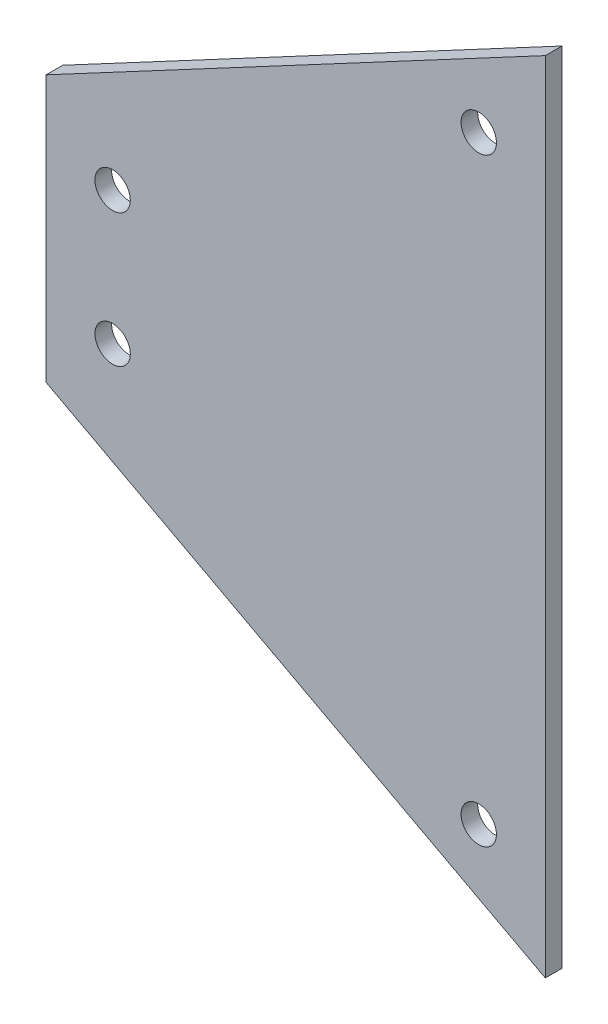
ISO-10303-21;
HEADER;
FILE_DESCRIPTION(('STEP AP214'),'2;1');
FILE_NAME('part.step','',(''),(''),'','','');
FILE_SCHEMA(('AUTOMOTIVE_DESIGN { 1 0 10303 214 1 1 1 1 }'));
ENDSEC;
DATA;
#1=APPLICATION_CONTEXT('core data for automotive mechanical design processes');
#2=APPLICATION_PROTOCOL_DEFINITION('international standard','automotive_design',2000,#1);
#3=PRODUCT_CONTEXT('',#1,'mechanical');
#4=PRODUCT('Part','Part','',(#3));
#5=PRODUCT_RELATED_PRODUCT_CATEGORY('part','',(#4));
#6=PRODUCT_DEFINITION_FORMATION('','',#4);
#7=PRODUCT_DEFINITION_CONTEXT('part definition',#1,'design');
#8=PRODUCT_DEFINITION('design','',#6,#7);
#9=PRODUCT_DEFINITION_SHAPE('','',#8);
#10=(LENGTH_UNIT() NAMED_UNIT(*) SI_UNIT(.MILLI.,.METRE.));
#11=(NAMED_UNIT(*) PLANE_ANGLE_UNIT() SI_UNIT($,.RADIAN.));
#12=(NAMED_UNIT(*) SI_UNIT($,.STERADIAN.) SOLID_ANGLE_UNIT());
#13=UNCERTAINTY_MEASURE_WITH_UNIT(LENGTH_MEASURE(1.E-05),#10,'distance_accuracy_value','');
#14=(GEOMETRIC_REPRESENTATION_CONTEXT(3) GLOBAL_UNCERTAINTY_ASSIGNED_CONTEXT((#13)) GLOBAL_UNIT_ASSIGNED_CONTEXT((#10,
#11,#12)) REPRESENTATION_CONTEXT('',''));
#15=CARTESIAN_POINT('',(0.,0.,0.));
#16=DIRECTION('',(0.,0.,1.));
#17=DIRECTION('',(1.,0.,0.));
#18=AXIS2_PLACEMENT_3D('',#15,#16,#17);
#19=CARTESIAN_POINT('',(-95.25,0.,1.5875));
#20=DIRECTION('',(-1.,0.,0.));
#21=DIRECTION('',(0.,0.,1.));
#22=AXIS2_PLACEMENT_3D('',#19,#20,#21);
#23=PLANE('',#22);
#24=DIRECTION('',(0.,1.,0.));
#25=VECTOR('',#24,1.);
#26=CARTESIAN_POINT('',(-95.25,0.,-1.5875));
#27=LINE('',#26,#25);
#28=CARTESIAN_POINT('',(-95.25,-25.4,-1.5875));
#29=VERTEX_POINT('',#28);
#30=CARTESIAN_POINT('',(-95.25,25.4,-1.5875));
#31=VERTEX_POINT('',#30);
#32=EDGE_CURVE('E99',#29,#31,#27,.T.);
#33=ORIENTED_EDGE('',*,*,#32,.F.);
#34=DIRECTION('',(0.,0.,-1.));
#35=VECTOR('',#34,1.);
#36=CARTESIAN_POINT('',(-95.25,-25.4,1.5875));
#37=LINE('',#36,#35);
#38=CARTESIAN_POINT('',(-95.25,-25.4,1.5875));
#39=VERTEX_POINT('',#38);
#40=EDGE_CURVE('E11',#39,#29,#37,.T.);
#41=ORIENTED_EDGE('',*,*,#40,.F.);
#42=DIRECTION('',(0.,1.,0.));
#43=VECTOR('',#42,1.);
#44=CARTESIAN_POINT('',(-95.25,0.,1.5875));
#45=LINE('',#44,#43);
#46=CARTESIAN_POINT('',(-95.25,25.4,1.5875));
#47=VERTEX_POINT('',#46);
#48=EDGE_CURVE('E92',#39,#47,#45,.T.);
#49=ORIENTED_EDGE('',*,*,#48,.T.);
#50=DIRECTION('',(0.,0.,-1.));
#51=VECTOR('',#50,1.);
#52=CARTESIAN_POINT('',(-95.25,25.4,1.5875));
#53=LINE('',#52,#51);
#54=EDGE_CURVE('E73',#47,#31,#53,.T.);
#55=ORIENTED_EDGE('',*,*,#54,.T.);
#56=EDGE_LOOP('',(#33,#41,#49,#55));
#57=FACE_BOUND('',#56,.T.);
#58=ADVANCED_FACE('F35',(#57),#23,.T.);
#59=CARTESIAN_POINT('',(-31.6401384083045,-59.3252595155709,1.5875));
#60=DIRECTION('',(-0.470588235294118,-0.88235294117647,0.));
#61=DIRECTION('',(0.882352941176471,-0.470588235294118,0.));
#62=AXIS2_PLACEMENT_3D('',#59,#60,#61);
#63=PLANE('',#62);
#64=DIRECTION('',(-0.882352941176471,0.470588235294118,0.));
#65=VECTOR('',#64,1.);
#66=CARTESIAN_POINT('',(-31.6401384083045,-59.3252595155709,-1.5875));
#67=LINE('',#66,#65);
#68=CARTESIAN_POINT('',(0.,-76.2,-1.5875));
#69=VERTEX_POINT('',#68);
#70=EDGE_CURVE('E86',#69,#29,#67,.T.);
#71=ORIENTED_EDGE('',*,*,#70,.F.);
#72=DIRECTION('',(0.,0.,-1.));
#73=VECTOR('',#72,1.);
#74=CARTESIAN_POINT('',(0.,-76.2,1.5875));
#75=LINE('',#74,#73);
#76=CARTESIAN_POINT('',(0.,-76.2,1.5875));
#77=VERTEX_POINT('',#76);
#78=EDGE_CURVE('E43',#77,#69,#75,.T.);
#79=ORIENTED_EDGE('',*,*,#78,.F.);
#80=DIRECTION('',(-0.882352941176471,0.470588235294118,0.));
#81=VECTOR('',#80,1.);
#82=CARTESIAN_POINT('',(-31.6401384083045,-59.3252595155709,1.5875));
#83=LINE('',#82,#81);
#84=EDGE_CURVE('E84',#77,#39,#83,.T.);
#85=ORIENTED_EDGE('',*,*,#84,.T.);
#86=ORIENTED_EDGE('',*,*,#40,.T.);
#87=EDGE_LOOP('',(#71,#79,#85,#86));
#88=FACE_BOUND('',#87,.T.);
#89=ADVANCED_FACE('F82',(#88),#63,.T.);
#90=CARTESIAN_POINT('',(0.,0.,1.5875));
#91=DIRECTION('',(-1.,0.,0.));
#92=DIRECTION('',(0.,-1.,0.));
#93=AXIS2_PLACEMENT_3D('',#90,#91,#92);
#94=PLANE('',#93);
#95=DIRECTION('',(0.,1.,0.));
#96=VECTOR('',#95,1.);
#97=CARTESIAN_POINT('',(0.,0.,-1.5875));
#98=LINE('',#97,#96);
#99=CARTESIAN_POINT('',(0.,76.2,-1.5875));
#100=VERTEX_POINT('',#99);
#101=EDGE_CURVE('E66',#69,#100,#98,.T.);
#102=ORIENTED_EDGE('',*,*,#101,.T.);
#103=DIRECTION('',(0.,0.,-1.));
#104=VECTOR('',#103,1.);
#105=CARTESIAN_POINT('',(0.,76.2,1.5875));
#106=LINE('',#105,#104);
#107=CARTESIAN_POINT('',(0.,76.2,1.5875));
#108=VERTEX_POINT('',#107);
#109=EDGE_CURVE('E87',#108,#100,#106,.T.);
#110=ORIENTED_EDGE('',*,*,#109,.F.);
#111=DIRECTION('',(0.,1.,0.));
#112=VECTOR('',#111,1.);
#113=CARTESIAN_POINT('',(0.,0.,1.5875));
#114=LINE('',#113,#112);
#115=EDGE_CURVE('E88',#77,#108,#114,.T.);
#116=ORIENTED_EDGE('',*,*,#115,.F.);
#117=ORIENTED_EDGE('',*,*,#78,.T.);
#118=EDGE_LOOP('',(#102,#110,#116,#117));
#119=FACE_BOUND('',#118,.T.);
#120=ADVANCED_FACE('F89',(#119),#94,.F.);
#121=CARTESIAN_POINT('',(-31.6401384083045,59.3252595155709,1.5875));
#122=DIRECTION('',(0.470588235294118,-0.88235294117647,0.));
#123=DIRECTION('',(0.882352941176471,0.470588235294118,0.));
#124=AXIS2_PLACEMENT_3D('',#121,#122,#123);
#125=PLANE('',#124);
#126=DIRECTION('',(-0.882352941176471,-0.470588235294118,0.));
#127=VECTOR('',#126,1.);
#128=CARTESIAN_POINT('',(-31.6401384083045,59.3252595155709,-1.5875));
#129=LINE('',#128,#127);
#130=EDGE_CURVE('E94',#100,#31,#129,.T.);
#131=ORIENTED_EDGE('',*,*,#130,.T.);
#132=ORIENTED_EDGE('',*,*,#54,.F.);
#133=DIRECTION('',(-0.882352941176471,-0.470588235294118,0.));
#134=VECTOR('',#133,1.);
#135=CARTESIAN_POINT('',(-31.6401384083045,59.3252595155709,1.5875));
#136=LINE('',#135,#134);
#137=EDGE_CURVE('E51',#108,#47,#136,.T.);
#138=ORIENTED_EDGE('',*,*,#137,.F.);
#139=ORIENTED_EDGE('',*,*,#109,.T.);
#140=EDGE_LOOP('',(#131,#132,#138,#139));
#141=FACE_BOUND('',#140,.T.);
#142=ADVANCED_FACE('F109',(#141),#125,.F.);
#143=CARTESIAN_POINT('',(0.,0.,1.5875));
#144=DIRECTION('',(0.,0.,1.));
#145=DIRECTION('',(1.,0.,0.));
#146=AXIS2_PLACEMENT_3D('',#143,#144,#145);
#147=PLANE('',#146);
#148=CARTESIAN_POINT('',(-82.55,12.7,1.5875));
#149=DIRECTION('',(0.,0.,1.));
#150=DIRECTION('',(1.,0.,0.));
#151=AXIS2_PLACEMENT_3D('',#148,#149,#150);
#152=CIRCLE('',#151,3.373501);
#153=CARTESIAN_POINT('',(-79.176499,12.7,1.5875));
#154=VERTEX_POINT('',#153);
#155=EDGE_CURVE('E152',#154,#154,#152,.T.);
#156=ORIENTED_EDGE('',*,*,#155,.F.);
#157=EDGE_LOOP('',(#156));
#158=FACE_BOUND('',#157,.T.);
#159=CARTESIAN_POINT('',(-82.55,-12.7,1.5875));
#160=DIRECTION('',(0.,0.,1.));
#161=DIRECTION('',(1.,0.,0.));
#162=AXIS2_PLACEMENT_3D('',#159,#160,#161);
#163=CIRCLE('',#162,3.373501);
#164=CARTESIAN_POINT('',(-79.176499,-12.7,1.5875));
#165=VERTEX_POINT('',#164);
#166=EDGE_CURVE('E154',#165,#165,#163,.T.);
#167=ORIENTED_EDGE('',*,*,#166,.F.);
#168=EDGE_LOOP('',(#167));
#169=FACE_BOUND('',#168,.T.);
#170=CARTESIAN_POINT('',(-12.7,-57.15,1.5875));
#171=DIRECTION('',(0.,0.,1.));
#172=DIRECTION('',(1.,0.,0.));
#173=AXIS2_PLACEMENT_3D('',#170,#171,#172);
#174=CIRCLE('',#173,3.373501);
#175=CARTESIAN_POINT('',(-9.32649899999997,-57.15,1.5875));
#176=VERTEX_POINT('',#175);
#177=EDGE_CURVE('E162',#176,#176,#174,.T.);
#178=ORIENTED_EDGE('',*,*,#177,.F.);
#179=EDGE_LOOP('',(#178));
#180=FACE_BOUND('',#179,.T.);
#181=CARTESIAN_POINT('',(-12.7,57.15,1.5875));
#182=DIRECTION('',(0.,0.,1.));
#183=DIRECTION('',(1.,0.,0.));
#184=AXIS2_PLACEMENT_3D('',#181,#182,#183);
#185=CIRCLE('',#184,3.373501);
#186=CARTESIAN_POINT('',(-9.32649899999998,57.15,1.5875));
#187=VERTEX_POINT('',#186);
#188=EDGE_CURVE('E168',#187,#187,#185,.T.);
#189=ORIENTED_EDGE('',*,*,#188,.F.);
#190=EDGE_LOOP('',(#189));
#191=FACE_BOUND('',#190,.T.);
#192=ORIENTED_EDGE('',*,*,#48,.F.);
#193=ORIENTED_EDGE('',*,*,#84,.F.);
#194=ORIENTED_EDGE('',*,*,#115,.T.);
#195=ORIENTED_EDGE('',*,*,#137,.T.);
#196=EDGE_LOOP('',(#192,#193,#194,#195));
#197=FACE_BOUND('',#196,.T.);
#198=ADVANCED_FACE('F91',(#158,#169,#180,#191,#197),#147,.T.);
#199=CARTESIAN_POINT('',(0.,0.,-1.5875));
#200=DIRECTION('',(0.,0.,1.));
#201=DIRECTION('',(1.,0.,0.));
#202=AXIS2_PLACEMENT_3D('',#199,#200,#201);
#203=PLANE('',#202);
#204=CARTESIAN_POINT('',(-82.55,12.7,-1.5875));
#205=DIRECTION('',(0.,0.,1.));
#206=DIRECTION('',(1.,0.,0.));
#207=AXIS2_PLACEMENT_3D('',#204,#205,#206);
#208=CIRCLE('',#207,3.373501);
#209=CARTESIAN_POINT('',(-79.176499,12.7,-1.5875));
#210=VERTEX_POINT('',#209);
#211=EDGE_CURVE('E149',#210,#210,#208,.T.);
#212=ORIENTED_EDGE('',*,*,#211,.T.);
#213=EDGE_LOOP('',(#212));
#214=FACE_BOUND('',#213,.T.);
#215=CARTESIAN_POINT('',(-82.55,-12.7,-1.5875));
#216=DIRECTION('',(0.,0.,1.));
#217=DIRECTION('',(1.,0.,0.));
#218=AXIS2_PLACEMENT_3D('',#215,#216,#217);
#219=CIRCLE('',#218,3.373501);
#220=CARTESIAN_POINT('',(-79.176499,-12.7,-1.5875));
#221=VERTEX_POINT('',#220);
#222=EDGE_CURVE('E159',#221,#221,#219,.T.);
#223=ORIENTED_EDGE('',*,*,#222,.T.);
#224=EDGE_LOOP('',(#223));
#225=FACE_BOUND('',#224,.T.);
#226=CARTESIAN_POINT('',(-12.7,-57.15,-1.5875));
#227=DIRECTION('',(0.,0.,1.));
#228=DIRECTION('',(1.,0.,0.));
#229=AXIS2_PLACEMENT_3D('',#226,#227,#228);
#230=CIRCLE('',#229,3.373501);
#231=CARTESIAN_POINT('',(-9.32649899999997,-57.15,-1.5875));
#232=VERTEX_POINT('',#231);
#233=EDGE_CURVE('E165',#232,#232,#230,.T.);
#234=ORIENTED_EDGE('',*,*,#233,.T.);
#235=EDGE_LOOP('',(#234));
#236=FACE_BOUND('',#235,.T.);
#237=CARTESIAN_POINT('',(-12.7,57.15,-1.5875));
#238=DIRECTION('',(0.,0.,1.));
#239=DIRECTION('',(1.,0.,0.));
#240=AXIS2_PLACEMENT_3D('',#237,#238,#239);
#241=CIRCLE('',#240,3.373501);
#242=CARTESIAN_POINT('',(-9.32649899999998,57.15,-1.5875));
#243=VERTEX_POINT('',#242);
#244=EDGE_CURVE('E102',#243,#243,#241,.T.);
#245=ORIENTED_EDGE('',*,*,#244,.T.);
#246=EDGE_LOOP('',(#245));
#247=FACE_BOUND('',#246,.T.);
#248=ORIENTED_EDGE('',*,*,#32,.T.);
#249=ORIENTED_EDGE('',*,*,#130,.F.);
#250=ORIENTED_EDGE('',*,*,#101,.F.);
#251=ORIENTED_EDGE('',*,*,#70,.T.);
#252=EDGE_LOOP('',(#248,#249,#250,#251));
#253=FACE_BOUND('',#252,.T.);
#254=ADVANCED_FACE('F111',(#214,#225,#236,#247,#253),#203,.F.);
#255=CARTESIAN_POINT('',(-12.7,57.15,1.5875));
#256=DIRECTION('',(0.,0.,1.));
#257=DIRECTION('',(1.,0.,0.));
#258=AXIS2_PLACEMENT_3D('',#255,#256,#257);
#259=CYLINDRICAL_SURFACE('',#258,3.373501);
#260=ORIENTED_EDGE('',*,*,#244,.F.);
#261=EDGE_LOOP('',(#260));
#262=FACE_BOUND('',#261,.T.);
#263=ORIENTED_EDGE('',*,*,#188,.T.);
#264=EDGE_LOOP('',(#263));
#265=FACE_BOUND('',#264,.T.);
#266=ADVANCED_FACE('F125',(#262,#265),#259,.F.);
#267=CARTESIAN_POINT('',(-12.7,-57.15,1.5875));
#268=DIRECTION('',(0.,0.,1.));
#269=DIRECTION('',(1.,0.,0.));
#270=AXIS2_PLACEMENT_3D('',#267,#268,#269);
#271=CYLINDRICAL_SURFACE('',#270,3.373501);
#272=ORIENTED_EDGE('',*,*,#233,.F.);
#273=EDGE_LOOP('',(#272));
#274=FACE_BOUND('',#273,.T.);
#275=ORIENTED_EDGE('',*,*,#177,.T.);
#276=EDGE_LOOP('',(#275));
#277=FACE_BOUND('',#276,.T.);
#278=ADVANCED_FACE('F132',(#274,#277),#271,.F.);
#279=CARTESIAN_POINT('',(-82.55,-12.7,1.5875));
#280=DIRECTION('',(0.,0.,1.));
#281=DIRECTION('',(1.,0.,0.));
#282=AXIS2_PLACEMENT_3D('',#279,#280,#281);
#283=CYLINDRICAL_SURFACE('',#282,3.373501);
#284=ORIENTED_EDGE('',*,*,#222,.F.);
#285=EDGE_LOOP('',(#284));
#286=FACE_BOUND('',#285,.T.);
#287=ORIENTED_EDGE('',*,*,#166,.T.);
#288=EDGE_LOOP('',(#287));
#289=FACE_BOUND('',#288,.T.);
#290=ADVANCED_FACE('F136',(#286,#289),#283,.F.);
#291=CARTESIAN_POINT('',(-82.55,12.7,1.5875));
#292=DIRECTION('',(0.,0.,1.));
#293=DIRECTION('',(1.,0.,0.));
#294=AXIS2_PLACEMENT_3D('',#291,#292,#293);
#295=CYLINDRICAL_SURFACE('',#294,3.373501);
#296=ORIENTED_EDGE('',*,*,#211,.F.);
#297=EDGE_LOOP('',(#296));
#298=FACE_BOUND('',#297,.T.);
#299=ORIENTED_EDGE('',*,*,#155,.T.);
#300=EDGE_LOOP('',(#299));
#301=FACE_BOUND('',#300,.T.);
#302=ADVANCED_FACE('F140',(#298,#301),#295,.F.);
#303=CLOSED_SHELL('',(#58,#89,#120,#142,#198,#254,#266,#278,#290,#302));
#304=MANIFOLD_SOLID_BREP('B2',#303);
#305=ADVANCED_BREP_SHAPE_REPRESENTATION('',(#18,#304),#14);
#306=SHAPE_DEFINITION_REPRESENTATION(#9,#305);
ENDSEC;
END-ISO-10303-21;
